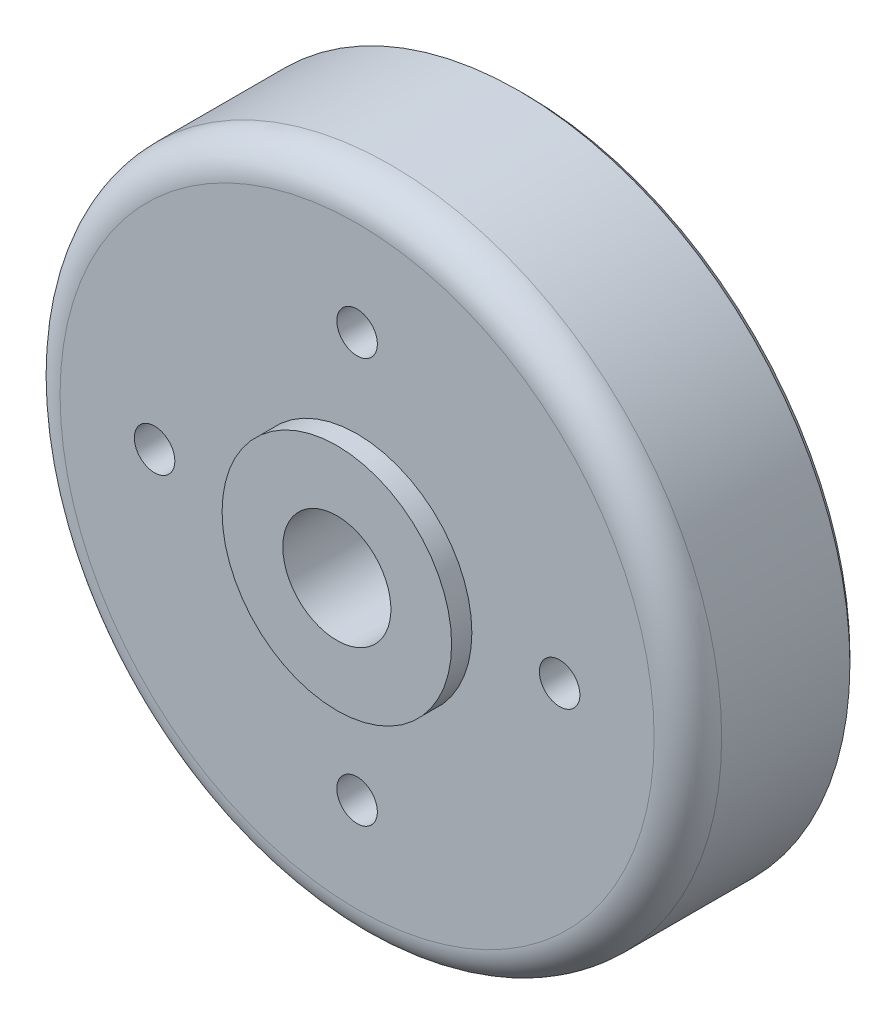
ISO-10303-21;
HEADER;
FILE_DESCRIPTION(('STEP AP214'),'2;1');
FILE_NAME('part.step','',(''),(''),'','','');
FILE_SCHEMA(('AUTOMOTIVE_DESIGN { 1 0 10303 214 1 1 1 1 }'));
ENDSEC;
DATA;
#1=APPLICATION_CONTEXT('core data for automotive mechanical design processes');
#2=APPLICATION_PROTOCOL_DEFINITION('international standard','automotive_design',2000,#1);
#3=PRODUCT_CONTEXT('',#1,'mechanical');
#4=PRODUCT('Part','Part','',(#3));
#5=PRODUCT_RELATED_PRODUCT_CATEGORY('part','',(#4));
#6=PRODUCT_DEFINITION_FORMATION('','',#4);
#7=PRODUCT_DEFINITION_CONTEXT('part definition',#1,'design');
#8=PRODUCT_DEFINITION('design','',#6,#7);
#9=PRODUCT_DEFINITION_SHAPE('','',#8);
#10=(LENGTH_UNIT() NAMED_UNIT(*) SI_UNIT(.MILLI.,.METRE.));
#11=(NAMED_UNIT(*) PLANE_ANGLE_UNIT() SI_UNIT($,.RADIAN.));
#12=(NAMED_UNIT(*) SI_UNIT($,.STERADIAN.) SOLID_ANGLE_UNIT());
#13=UNCERTAINTY_MEASURE_WITH_UNIT(LENGTH_MEASURE(1.E-05),#10,'distance_accuracy_value','');
#14=(GEOMETRIC_REPRESENTATION_CONTEXT(3) GLOBAL_UNCERTAINTY_ASSIGNED_CONTEXT((#13)) GLOBAL_UNIT_ASSIGNED_CONTEXT((#10,
#11,#12)) REPRESENTATION_CONTEXT('',''));
#15=CARTESIAN_POINT('',(0.,0.,0.));
#16=DIRECTION('',(0.,0.,1.));
#17=DIRECTION('',(1.,0.,0.));
#18=AXIS2_PLACEMENT_3D('',#15,#16,#17);
#19=CARTESIAN_POINT('',(6.34094898225185E-12,0.,29166.6666666667));
#20=DIRECTION('',(0.,0.,-1.));
#21=DIRECTION('',(-1.,0.,0.));
#22=AXIS2_PLACEMENT_3D('',#19,#20,#21);
#23=PLANE('',#22);
#24=CARTESIAN_POINT('',(0.,0.,29166.6666666667));
#25=DIRECTION('',(0.,0.,-1.));
#26=DIRECTION('',(-1.,0.,0.));
#27=AXIS2_PLACEMENT_3D('',#24,#25,#26);
#28=CIRCLE('',#27,8000.);
#29=CARTESIAN_POINT('',(-8000.,0.,29166.6666666667));
#30=VERTEX_POINT('',#29);
#31=EDGE_CURVE('E91',#30,#30,#28,.T.);
#32=ORIENTED_EDGE('',*,*,#31,.T.);
#33=EDGE_LOOP('',(#32));
#34=FACE_BOUND('',#33,.T.);
#35=CARTESIAN_POINT('',(0.,0.,29166.6666666667));
#36=DIRECTION('',(0.,0.,-1.));
#37=DIRECTION('',(-1.,0.,0.));
#38=AXIS2_PLACEMENT_3D('',#35,#36,#37);
#39=CIRCLE('',#38,17000.);
#40=CARTESIAN_POINT('',(-17000.,0.,29166.6666666667));
#41=VERTEX_POINT('',#40);
#42=EDGE_CURVE('E65',#41,#41,#39,.T.);
#43=ORIENTED_EDGE('',*,*,#42,.F.);
#44=EDGE_LOOP('',(#43));
#45=FACE_BOUND('',#44,.T.);
#46=ADVANCED_FACE('F33',(#34,#45),#23,.F.);
#47=CARTESIAN_POINT('',(0.,0.,-29842.0771719763));
#48=DIRECTION('',(0.,0.,-1.));
#49=DIRECTION('',(-1.,0.,0.));
#50=AXIS2_PLACEMENT_3D('',#47,#48,#49);
#51=CYLINDRICAL_SURFACE('',#50,17000.);
#52=CARTESIAN_POINT('',(0.,0.,26166.6666666667));
#53=DIRECTION('',(0.,0.,-1.));
#54=DIRECTION('',(-1.,0.,0.));
#55=AXIS2_PLACEMENT_3D('',#52,#53,#54);
#56=CIRCLE('',#55,17000.);
#57=CARTESIAN_POINT('',(-17000.,0.,26166.6666666667));
#58=VERTEX_POINT('',#57);
#59=EDGE_CURVE('E82',#58,#58,#56,.T.);
#60=ORIENTED_EDGE('',*,*,#59,.F.);
#61=EDGE_LOOP('',(#60));
#62=FACE_BOUND('',#61,.T.);
#63=ORIENTED_EDGE('',*,*,#42,.T.);
#64=EDGE_LOOP('',(#63));
#65=FACE_BOUND('',#64,.T.);
#66=ADVANCED_FACE('F115',(#62,#65),#51,.T.);
#67=CARTESIAN_POINT('',(17000.,0.,26166.6666666667));
#68=DIRECTION('',(0.,0.,-1.));
#69=DIRECTION('',(-1.,0.,0.));
#70=AXIS2_PLACEMENT_3D('',#67,#68,#69);
#71=PLANE('',#70);
#72=CARTESIAN_POINT('',(0.,0.,26166.6666666667));
#73=DIRECTION('',(0.,0.,-1.));
#74=DIRECTION('',(-1.,0.,0.));
#75=AXIS2_PLACEMENT_3D('',#72,#73,#74);
#76=CIRCLE('',#75,44000.);
#77=CARTESIAN_POINT('',(-44000.,0.,26166.6666666667));
#78=VERTEX_POINT('',#77);
#79=EDGE_CURVE('E59',#78,#78,#76,.F.);
#80=ORIENTED_EDGE('',*,*,#79,.T.);
#81=EDGE_LOOP('',(#80));
#82=FACE_BOUND('',#81,.T.);
#83=CARTESIAN_POINT('',(0.,30000.,26166.6666666667));
#84=DIRECTION('',(0.,0.,1.));
#85=DIRECTION('',(1.,0.,0.));
#86=AXIS2_PLACEMENT_3D('',#83,#84,#85);
#87=CIRCLE('',#86,3000.);
#88=CARTESIAN_POINT('',(3000.,30000.,26166.6666666667));
#89=VERTEX_POINT('',#88);
#90=EDGE_CURVE('E79',#89,#89,#87,.T.);
#91=ORIENTED_EDGE('',*,*,#90,.F.);
#92=EDGE_LOOP('',(#91));
#93=FACE_BOUND('',#92,.T.);
#94=CARTESIAN_POINT('',(30000.,3.43148696015857E-12,26166.6666666667));
#95=DIRECTION('',(0.,0.,1.));
#96=DIRECTION('',(1.,0.,0.));
#97=AXIS2_PLACEMENT_3D('',#94,#95,#96);
#98=CIRCLE('',#97,3000.00000000011);
#99=CARTESIAN_POINT('',(33000.0000000001,3.43148696015857E-12,26166.6666666667));
#100=VERTEX_POINT('',#99);
#101=EDGE_CURVE('E102',#100,#100,#98,.T.);
#102=ORIENTED_EDGE('',*,*,#101,.F.);
#103=EDGE_LOOP('',(#102));
#104=FACE_BOUND('',#103,.T.);
#105=CARTESIAN_POINT('',(-3.6739403974417E-12,-30000.,26166.6666666667));
#106=DIRECTION('',(0.,0.,1.));
#107=DIRECTION('',(1.,0.,0.));
#108=AXIS2_PLACEMENT_3D('',#105,#106,#107);
#109=CIRCLE('',#108,3000.0000000002);
#110=CARTESIAN_POINT('',(3000.0000000002,-30000.,26166.6666666667));
#111=VERTEX_POINT('',#110);
#112=EDGE_CURVE('E99',#111,#111,#109,.T.);
#113=ORIENTED_EDGE('',*,*,#112,.F.);
#114=EDGE_LOOP('',(#113));
#115=FACE_BOUND('',#114,.T.);
#116=CARTESIAN_POINT('',(-30000.,3.43148696015859E-12,26166.6666666667));
#117=DIRECTION('',(0.,0.,1.));
#118=DIRECTION('',(1.,0.,0.));
#119=AXIS2_PLACEMENT_3D('',#116,#117,#118);
#120=CIRCLE('',#119,3000.0000000003);
#121=CARTESIAN_POINT('',(-26999.9999999997,3.43148696015859E-12,26166.6666666667));
#122=VERTEX_POINT('',#121);
#123=EDGE_CURVE('E96',#122,#122,#120,.T.);
#124=ORIENTED_EDGE('',*,*,#123,.F.);
#125=EDGE_LOOP('',(#124));
#126=FACE_BOUND('',#125,.T.);
#127=ORIENTED_EDGE('',*,*,#59,.T.);
#128=EDGE_LOOP('',(#127));
#129=FACE_BOUND('',#128,.T.);
#130=ADVANCED_FACE('F111',(#82,#93,#104,#115,#126,#129),#71,.F.);
#131=CARTESIAN_POINT('',(0.,0.,-29842.0771719763));
#132=DIRECTION('',(0.,0.,-1.));
#133=DIRECTION('',(-1.,0.,0.));
#134=AXIS2_PLACEMENT_3D('',#131,#132,#133);
#135=CYLINDRICAL_SURFACE('',#134,49000.);
#136=CARTESIAN_POINT('',(0.,0.,2166.6666666667));
#137=DIRECTION('',(0.,0.,1.));
#138=DIRECTION('',(1.,0.,0.));
#139=AXIS2_PLACEMENT_3D('',#136,#137,#138);
#140=CIRCLE('',#139,49000.);
#141=CARTESIAN_POINT('',(49000.,0.,2166.6666666667));
#142=VERTEX_POINT('',#141);
#143=EDGE_CURVE('E10',#142,#142,#140,.T.);
#144=ORIENTED_EDGE('',*,*,#143,.T.);
#145=EDGE_LOOP('',(#144));
#146=FACE_BOUND('',#145,.T.);
#147=CARTESIAN_POINT('',(0.,0.,21166.6666666667));
#148=DIRECTION('',(0.,0.,-1.));
#149=DIRECTION('',(-1.,0.,0.));
#150=AXIS2_PLACEMENT_3D('',#147,#148,#149);
#151=CIRCLE('',#150,49000.);
#152=CARTESIAN_POINT('',(-49000.,0.,21166.6666666667));
#153=VERTEX_POINT('',#152);
#154=EDGE_CURVE('E62',#153,#153,#151,.T.);
#155=ORIENTED_EDGE('',*,*,#154,.T.);
#156=EDGE_LOOP('',(#155));
#157=FACE_BOUND('',#156,.T.);
#158=ADVANCED_FACE('F114',(#146,#157),#135,.T.);
#159=CARTESIAN_POINT('',(49000.,0.,1166.66666666666));
#160=DIRECTION('',(0.,0.,1.));
#161=DIRECTION('',(1.,0.,0.));
#162=AXIS2_PLACEMENT_3D('',#159,#160,#161);
#163=PLANE('',#162);
#164=CARTESIAN_POINT('',(0.,0.,1166.66666666666));
#165=DIRECTION('',(0.,0.,1.));
#166=DIRECTION('',(1.,0.,0.));
#167=AXIS2_PLACEMENT_3D('',#164,#165,#166);
#168=CIRCLE('',#167,48000.);
#169=CARTESIAN_POINT('',(48000.,0.,1166.66666666666));
#170=VERTEX_POINT('',#169);
#171=EDGE_CURVE('E40',#170,#170,#168,.F.);
#172=ORIENTED_EDGE('',*,*,#171,.T.);
#173=EDGE_LOOP('',(#172));
#174=FACE_BOUND('',#173,.T.);
#175=CARTESIAN_POINT('',(0.,0.,1166.66666666666));
#176=DIRECTION('',(0.,0.,-1.));
#177=DIRECTION('',(-1.,0.,0.));
#178=AXIS2_PLACEMENT_3D('',#175,#176,#177);
#179=CIRCLE('',#178,45000.);
#180=CARTESIAN_POINT('',(-45000.,0.,1166.66666666666));
#181=VERTEX_POINT('',#180);
#182=EDGE_CURVE('E85',#181,#181,#179,.T.);
#183=ORIENTED_EDGE('',*,*,#182,.F.);
#184=EDGE_LOOP('',(#183));
#185=FACE_BOUND('',#184,.T.);
#186=ADVANCED_FACE('F186',(#174,#185),#163,.F.);
#187=CARTESIAN_POINT('',(0.,0.,1166.66666666666));
#188=DIRECTION('',(0.,0.,-1.));
#189=DIRECTION('',(-1.,0.,0.));
#190=AXIS2_PLACEMENT_3D('',#187,#188,#189);
#191=CONICAL_SURFACE('',#190,45000.,0.132551532296675);
#192=CARTESIAN_POINT('',(0.,0.,14430.9941068487));
#193=DIRECTION('',(0.,0.,-1.));
#194=DIRECTION('',(-1.,0.,0.));
#195=AXIS2_PLACEMENT_3D('',#192,#193,#194);
#196=CIRCLE('',#195,43231.4230079757);
#197=CARTESIAN_POINT('',(-43231.4230079757,0.,14430.9941068487));
#198=VERTEX_POINT('',#197);
#199=EDGE_CURVE('E53',#198,#198,#196,.F.);
#200=ORIENTED_EDGE('',*,*,#199,.T.);
#201=EDGE_LOOP('',(#200));
#202=FACE_BOUND('',#201,.T.);
#203=ORIENTED_EDGE('',*,*,#182,.T.);
#204=EDGE_LOOP('',(#203));
#205=FACE_BOUND('',#204,.T.);
#206=ADVANCED_FACE('F182',(#202,#205),#191,.F.);
#207=CARTESIAN_POINT('',(43000.,0.,16166.6666666667));
#208=DIRECTION('',(0.,0.,1.));
#209=DIRECTION('',(1.,0.,0.));
#210=AXIS2_PLACEMENT_3D('',#207,#208,#209);
#211=PLANE('',#210);
#212=CARTESIAN_POINT('',(0.,0.,16166.6666666667));
#213=DIRECTION('',(0.,0.,1.));
#214=DIRECTION('',(1.,0.,0.));
#215=AXIS2_PLACEMENT_3D('',#212,#213,#214);
#216=CIRCLE('',#215,41248.9672066105);
#217=CARTESIAN_POINT('',(41248.9672066105,0.,16166.6666666667));
#218=VERTEX_POINT('',#217);
#219=EDGE_CURVE('E56',#218,#218,#216,.F.);
#220=ORIENTED_EDGE('',*,*,#219,.T.);
#221=EDGE_LOOP('',(#220));
#222=FACE_BOUND('',#221,.T.);
#223=CARTESIAN_POINT('',(0.,30000.,16166.6666666667));
#224=DIRECTION('',(0.,0.,1.));
#225=DIRECTION('',(1.,0.,0.));
#226=AXIS2_PLACEMENT_3D('',#223,#224,#225);
#227=CIRCLE('',#226,3000.);
#228=CARTESIAN_POINT('',(3000.,30000.,16166.6666666667));
#229=VERTEX_POINT('',#228);
#230=EDGE_CURVE('E66',#229,#229,#227,.T.);
#231=ORIENTED_EDGE('',*,*,#230,.T.);
#232=EDGE_LOOP('',(#231));
#233=FACE_BOUND('',#232,.T.);
#234=CARTESIAN_POINT('',(30000.,3.43148696015857E-12,16166.6666666667));
#235=DIRECTION('',(0.,0.,1.));
#236=DIRECTION('',(1.,0.,0.));
#237=AXIS2_PLACEMENT_3D('',#234,#235,#236);
#238=CIRCLE('',#237,3000.00000000011);
#239=CARTESIAN_POINT('',(33000.0000000001,3.43148696015857E-12,16166.6666666667));
#240=VERTEX_POINT('',#239);
#241=EDGE_CURVE('E70',#240,#240,#238,.T.);
#242=ORIENTED_EDGE('',*,*,#241,.T.);
#243=EDGE_LOOP('',(#242));
#244=FACE_BOUND('',#243,.T.);
#245=CARTESIAN_POINT('',(-3.6739403974417E-12,-30000.,16166.6666666667));
#246=DIRECTION('',(0.,0.,1.));
#247=DIRECTION('',(1.,0.,0.));
#248=AXIS2_PLACEMENT_3D('',#245,#246,#247);
#249=CIRCLE('',#248,3000.0000000002);
#250=CARTESIAN_POINT('',(3000.0000000002,-30000.,16166.6666666667));
#251=VERTEX_POINT('',#250);
#252=EDGE_CURVE('E73',#251,#251,#249,.T.);
#253=ORIENTED_EDGE('',*,*,#252,.T.);
#254=EDGE_LOOP('',(#253));
#255=FACE_BOUND('',#254,.T.);
#256=CARTESIAN_POINT('',(-30000.,3.43148696015859E-12,16166.6666666667));
#257=DIRECTION('',(0.,0.,1.));
#258=DIRECTION('',(1.,0.,0.));
#259=AXIS2_PLACEMENT_3D('',#256,#257,#258);
#260=CIRCLE('',#259,3000.0000000003);
#261=CARTESIAN_POINT('',(-26999.9999999997,3.43148696015859E-12,16166.6666666667));
#262=VERTEX_POINT('',#261);
#263=EDGE_CURVE('E76',#262,#262,#260,.T.);
#264=ORIENTED_EDGE('',*,*,#263,.T.);
#265=EDGE_LOOP('',(#264));
#266=FACE_BOUND('',#265,.T.);
#267=CARTESIAN_POINT('',(0.,0.,16166.6666666667));
#268=DIRECTION('',(0.,0.,-1.));
#269=DIRECTION('',(-1.,0.,0.));
#270=AXIS2_PLACEMENT_3D('',#267,#268,#269);
#271=CIRCLE('',#270,17000.);
#272=CARTESIAN_POINT('',(-17000.,0.,16166.6666666667));
#273=VERTEX_POINT('',#272);
#274=EDGE_CURVE('E88',#273,#273,#271,.T.);
#275=ORIENTED_EDGE('',*,*,#274,.F.);
#276=EDGE_LOOP('',(#275));
#277=FACE_BOUND('',#276,.T.);
#278=ADVANCED_FACE('F178',(#222,#233,#244,#255,#266,#277),#211,.F.);
#279=CARTESIAN_POINT('',(0.,0.,16166.6666666667));
#280=DIRECTION('',(0.,0.,1.));
#281=DIRECTION('',(1.,0.,0.));
#282=AXIS2_PLACEMENT_3D('',#279,#280,#281);
#283=CONICAL_SURFACE('',#282,17000.,0.096473775182587);
#284=CARTESIAN_POINT('',(0.,0.,-13025.9817230537));
#285=DIRECTION('',(0.,0.,-1.));
#286=DIRECTION('',(-1.,0.,0.));
#287=AXIS2_PLACEMENT_3D('',#284,#285,#286);
#288=CIRCLE('',#287,14174.9049945432);
#289=CARTESIAN_POINT('',(-14174.9049945432,0.,-13025.9817230537));
#290=VERTEX_POINT('',#289);
#291=EDGE_CURVE('E44',#290,#290,#288,.F.);
#292=ORIENTED_EDGE('',*,*,#291,.T.);
#293=EDGE_LOOP('',(#292));
#294=FACE_BOUND('',#293,.T.);
#295=ORIENTED_EDGE('',*,*,#274,.T.);
#296=EDGE_LOOP('',(#295));
#297=FACE_BOUND('',#296,.T.);
#298=ADVANCED_FACE('F159',(#294,#297),#283,.T.);
#299=CARTESIAN_POINT('',(14000.,0.,-14833.3333333333));
#300=DIRECTION('',(0.,0.,1.));
#301=DIRECTION('',(1.,0.,0.));
#302=AXIS2_PLACEMENT_3D('',#299,#300,#301);
#303=PLANE('',#302);
#304=CARTESIAN_POINT('',(0.,0.,-14833.3333333333));
#305=DIRECTION('',(0.,0.,1.));
#306=DIRECTION('',(1.,0.,0.));
#307=AXIS2_PLACEMENT_3D('',#304,#305,#306);
#308=CIRCLE('',#307,12184.2049674326);
#309=CARTESIAN_POINT('',(12184.2049674326,0.,-14833.3333333333));
#310=VERTEX_POINT('',#309);
#311=EDGE_CURVE('E48',#310,#310,#308,.F.);
#312=ORIENTED_EDGE('',*,*,#311,.T.);
#313=EDGE_LOOP('',(#312));
#314=FACE_BOUND('',#313,.T.);
#315=CARTESIAN_POINT('',(0.,0.,-14833.3333333333));
#316=DIRECTION('',(0.,0.,-1.));
#317=DIRECTION('',(-1.,0.,0.));
#318=AXIS2_PLACEMENT_3D('',#315,#316,#317);
#319=CIRCLE('',#318,8000.);
#320=CARTESIAN_POINT('',(-8000.,0.,-14833.3333333333));
#321=VERTEX_POINT('',#320);
#322=EDGE_CURVE('E69',#321,#321,#319,.T.);
#323=ORIENTED_EDGE('',*,*,#322,.F.);
#324=EDGE_LOOP('',(#323));
#325=FACE_BOUND('',#324,.T.);
#326=ADVANCED_FACE('F155',(#314,#325),#303,.F.);
#327=CARTESIAN_POINT('',(0.,0.,35166.6666666667));
#328=DIRECTION('',(0.,0.,-1.));
#329=DIRECTION('',(-1.,0.,0.));
#330=AXIS2_PLACEMENT_3D('',#327,#328,#329);
#331=CYLINDRICAL_SURFACE('',#330,8000.);
#332=ORIENTED_EDGE('',*,*,#322,.T.);
#333=EDGE_LOOP('',(#332));
#334=FACE_BOUND('',#333,.T.);
#335=ORIENTED_EDGE('',*,*,#31,.F.);
#336=EDGE_LOOP('',(#335));
#337=FACE_BOUND('',#336,.T.);
#338=ADVANCED_FACE('F158',(#334,#337),#331,.F.);
#339=CARTESIAN_POINT('',(-30000.,3.43148696015859E-12,-23833.3333333333));
#340=DIRECTION('',(0.,0.,1.));
#341=DIRECTION('',(1.,0.,0.));
#342=AXIS2_PLACEMENT_3D('',#339,#340,#341);
#343=CYLINDRICAL_SURFACE('',#342,3000.0000000003);
#344=ORIENTED_EDGE('',*,*,#123,.T.);
#345=EDGE_LOOP('',(#344));
#346=FACE_BOUND('',#345,.T.);
#347=ORIENTED_EDGE('',*,*,#263,.F.);
#348=EDGE_LOOP('',(#347));
#349=FACE_BOUND('',#348,.T.);
#350=ADVANCED_FACE('F165',(#346,#349),#343,.F.);
#351=CARTESIAN_POINT('',(-3.6739403974417E-12,-30000.,-23833.3333333333));
#352=DIRECTION('',(0.,0.,1.));
#353=DIRECTION('',(1.,0.,0.));
#354=AXIS2_PLACEMENT_3D('',#351,#352,#353);
#355=CYLINDRICAL_SURFACE('',#354,3000.0000000002);
#356=ORIENTED_EDGE('',*,*,#112,.T.);
#357=EDGE_LOOP('',(#356));
#358=FACE_BOUND('',#357,.T.);
#359=ORIENTED_EDGE('',*,*,#252,.F.);
#360=EDGE_LOOP('',(#359));
#361=FACE_BOUND('',#360,.T.);
#362=ADVANCED_FACE('F171',(#358,#361),#355,.F.);
#363=CARTESIAN_POINT('',(30000.,3.43148696015857E-12,-23833.3333333333));
#364=DIRECTION('',(0.,0.,1.));
#365=DIRECTION('',(1.,0.,0.));
#366=AXIS2_PLACEMENT_3D('',#363,#364,#365);
#367=CYLINDRICAL_SURFACE('',#366,3000.00000000011);
#368=ORIENTED_EDGE('',*,*,#101,.T.);
#369=EDGE_LOOP('',(#368));
#370=FACE_BOUND('',#369,.T.);
#371=ORIENTED_EDGE('',*,*,#241,.F.);
#372=EDGE_LOOP('',(#371));
#373=FACE_BOUND('',#372,.T.);
#374=ADVANCED_FACE('F249',(#370,#373),#367,.F.);
#375=CARTESIAN_POINT('',(0.,30000.,-23833.3333333333));
#376=DIRECTION('',(0.,0.,1.));
#377=DIRECTION('',(1.,0.,0.));
#378=AXIS2_PLACEMENT_3D('',#375,#376,#377);
#379=CYLINDRICAL_SURFACE('',#378,3000.);
#380=ORIENTED_EDGE('',*,*,#90,.T.);
#381=EDGE_LOOP('',(#380));
#382=FACE_BOUND('',#381,.T.);
#383=ORIENTED_EDGE('',*,*,#230,.F.);
#384=EDGE_LOOP('',(#383));
#385=FACE_BOUND('',#384,.T.);
#386=ADVANCED_FACE('F108',(#382,#385),#379,.F.);
#387=CARTESIAN_POINT('',(0.,0.,21166.6666666667));
#388=DIRECTION('',(0.,0.,-1.));
#389=DIRECTION('',(-1.,0.,0.));
#390=AXIS2_PLACEMENT_3D('',#387,#388,#389);
#391=TOROIDAL_SURFACE('',#390,44000.,5000.);
#392=ORIENTED_EDGE('',*,*,#79,.F.);
#393=EDGE_LOOP('',(#392));
#394=FACE_BOUND('',#393,.T.);
#395=ORIENTED_EDGE('',*,*,#154,.F.);
#396=EDGE_LOOP('',(#395));
#397=FACE_BOUND('',#396,.T.);
#398=ADVANCED_FACE('F137',(#394,#397),#391,.T.);
#399=CARTESIAN_POINT('',(0.,0.,14166.6666666667));
#400=DIRECTION('',(0.,0.,1.));
#401=DIRECTION('',(1.,0.,0.));
#402=AXIS2_PLACEMENT_3D('',#399,#400,#401);
#403=TOROIDAL_SURFACE('',#402,41248.9672066105,2000.);
#404=ORIENTED_EDGE('',*,*,#199,.F.);
#405=EDGE_LOOP('',(#404));
#406=FACE_BOUND('',#405,.T.);
#407=ORIENTED_EDGE('',*,*,#219,.F.);
#408=EDGE_LOOP('',(#407));
#409=FACE_BOUND('',#408,.T.);
#410=ADVANCED_FACE('F140',(#406,#409),#403,.F.);
#411=CARTESIAN_POINT('',(0.,0.,-12833.3333333333));
#412=DIRECTION('',(0.,0.,1.));
#413=DIRECTION('',(1.,0.,0.));
#414=AXIS2_PLACEMENT_3D('',#411,#412,#413);
#415=TOROIDAL_SURFACE('',#414,12184.2049674326,2000.);
#416=ORIENTED_EDGE('',*,*,#291,.F.);
#417=EDGE_LOOP('',(#416));
#418=FACE_BOUND('',#417,.T.);
#419=ORIENTED_EDGE('',*,*,#311,.F.);
#420=EDGE_LOOP('',(#419));
#421=FACE_BOUND('',#420,.T.);
#422=ADVANCED_FACE('F143',(#418,#421),#415,.T.);
#423=CARTESIAN_POINT('',(0.,0.,1166.66666666666));
#424=DIRECTION('',(0.,0.,1.));
#425=DIRECTION('',(1.,0.,0.));
#426=AXIS2_PLACEMENT_3D('',#423,#424,#425);
#427=CONICAL_SURFACE('',#426,48000.,0.785398163397439);
#428=ORIENTED_EDGE('',*,*,#143,.F.);
#429=EDGE_LOOP('',(#428));
#430=FACE_BOUND('',#429,.T.);
#431=ORIENTED_EDGE('',*,*,#171,.F.);
#432=EDGE_LOOP('',(#431));
#433=FACE_BOUND('',#432,.T.);
#434=ADVANCED_FACE('F35',(#430,#433),#427,.T.);
#435=CLOSED_SHELL('',(#46,#66,#130,#158,#186,#206,#278,#298,#326,#338,#350,#362,#374,#386,#398,
#410,#422,#434));
#436=MANIFOLD_SOLID_BREP('B2',#435);
#437=ADVANCED_BREP_SHAPE_REPRESENTATION('',(#18,#436),#14);
#438=SHAPE_DEFINITION_REPRESENTATION(#9,#437);
ENDSEC;
END-ISO-10303-21;
